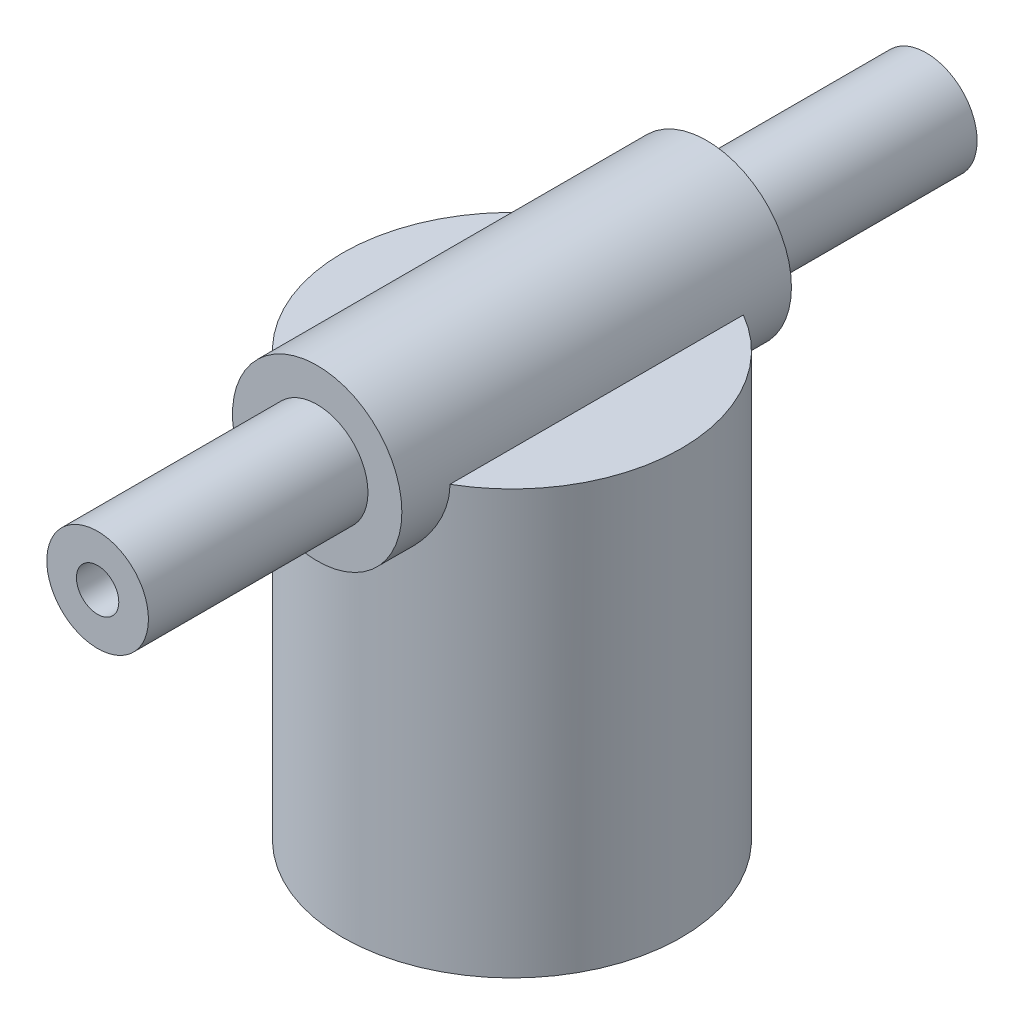
ISO-10303-21;
HEADER;
FILE_DESCRIPTION(('STEP AP214'),'2;1');
FILE_NAME('part.step','',(''),(''),'','','');
FILE_SCHEMA(('AUTOMOTIVE_DESIGN { 1 0 10303 214 1 1 1 1 }'));
ENDSEC;
DATA;
#1=APPLICATION_CONTEXT('core data for automotive mechanical design processes');
#2=APPLICATION_PROTOCOL_DEFINITION('international standard','automotive_design',2000,#1);
#3=PRODUCT_CONTEXT('',#1,'mechanical');
#4=PRODUCT('Part','Part','',(#3));
#5=PRODUCT_RELATED_PRODUCT_CATEGORY('part','',(#4));
#6=PRODUCT_DEFINITION_FORMATION('','',#4);
#7=PRODUCT_DEFINITION_CONTEXT('part definition',#1,'design');
#8=PRODUCT_DEFINITION('design','',#6,#7);
#9=PRODUCT_DEFINITION_SHAPE('','',#8);
#10=(LENGTH_UNIT() NAMED_UNIT(*) SI_UNIT(.MILLI.,.METRE.));
#11=(NAMED_UNIT(*) PLANE_ANGLE_UNIT() SI_UNIT($,.RADIAN.));
#12=(NAMED_UNIT(*) SI_UNIT($,.STERADIAN.) SOLID_ANGLE_UNIT());
#13=UNCERTAINTY_MEASURE_WITH_UNIT(LENGTH_MEASURE(1.E-05),#10,'distance_accuracy_value','');
#14=(GEOMETRIC_REPRESENTATION_CONTEXT(3) GLOBAL_UNCERTAINTY_ASSIGNED_CONTEXT((#13)) GLOBAL_UNIT_ASSIGNED_CONTEXT((#10,
#11,#12)) REPRESENTATION_CONTEXT('',''));
#15=CARTESIAN_POINT('',(0.,0.,0.));
#16=DIRECTION('',(0.,0.,1.));
#17=DIRECTION('',(1.,0.,0.));
#18=AXIS2_PLACEMENT_3D('',#15,#16,#17);
#19=CARTESIAN_POINT('',(0.,50.,0.));
#20=DIRECTION('',(0.,-1.,0.));
#21=DIRECTION('',(0.,0.,-1.));
#22=AXIS2_PLACEMENT_3D('',#19,#20,#21);
#23=CYLINDRICAL_SURFACE('',#22,20.);
#24=CARTESIAN_POINT('',(0.,0.,0.));
#25=DIRECTION('',(0.,1.,0.));
#26=DIRECTION('',(0.,0.,1.));
#27=AXIS2_PLACEMENT_3D('',#24,#25,#26);
#28=CIRCLE('',#27,20.);
#29=CARTESIAN_POINT('',(0.,0.,20.));
#30=VERTEX_POINT('',#29);
#31=EDGE_CURVE('E75',#30,#30,#28,.T.);
#32=ORIENTED_EDGE('',*,*,#31,.T.);
#33=EDGE_LOOP('',(#32));
#34=FACE_BOUND('',#33,.T.);
#35=CARTESIAN_POINT('',(0.,60.,-20.));
#36=CARTESIAN_POINT('',(0.26297774757047,59.9999991311544,-19.9999992010162));
#37=CARTESIAN_POINT('',(0.525973881907791,59.9896144860554,-19.9948010837));
#38=CARTESIAN_POINT('',(1.05002923117121,59.9481941751404,-19.9741395354228));
#39=CARTESIAN_POINT('',(1.31108755349614,59.9171495254669,-19.9586716387275));
#40=CARTESIAN_POINT('',(1.82963226043827,59.8347080895986,-19.9178362229901));
#41=CARTESIAN_POINT('',(2.08711188872546,59.7832771145179,-19.8924520749392));
#42=CARTESIAN_POINT('',(2.59618182802919,59.6606617858704,-19.8324363448083));
#43=CARTESIAN_POINT('',(2.847772725312,59.5894794078488,-19.7978056875818));
#44=CARTESIAN_POINT('',(3.34246836822569,59.4284309978279,-19.720303023444));
#45=CARTESIAN_POINT('',(3.58560245696295,59.3386391325444,-19.6774637808779));
#46=CARTESIAN_POINT('',(4.06298432085465,59.1410556783159,-19.5844658749963));
#47=CARTESIAN_POINT('',(4.29723190454895,59.0332637018277,-19.5343070540929));
#48=CARTESIAN_POINT('',(4.75551398861712,58.8006307634748,-19.4278257394007));
#49=CARTESIAN_POINT('',(4.97955221985718,58.6757960973552,-19.371505523214));
#50=CARTESIAN_POINT('',(5.41653080360957,58.4099130709816,-19.2538936046229));
#51=CARTESIAN_POINT('',(5.62946673237805,58.2688583184689,-19.1925999450287));
#52=CARTESIAN_POINT('',(6.05571153636931,57.9624954366143,-19.0625536763854));
#53=CARTESIAN_POINT('',(6.2682689260733,57.7962377965806,-18.9935741626949));
#54=CARTESIAN_POINT('',(6.67880739057353,57.4475548696851,-18.8531326273725));
#55=CARTESIAN_POINT('',(6.8767876309065,57.265128658575,-18.7816704639663));
#56=CARTESIAN_POINT('',(7.25738906236846,56.8849614203297,-18.6379106306311));
#57=CARTESIAN_POINT('',(7.44000060064986,56.6872109157941,-18.5656124675679));
#58=CARTESIAN_POINT('',(7.7888836174931,56.2773980437752,-18.4219676840917));
#59=CARTESIAN_POINT('',(7.95515202519227,56.0653329991786,-18.3506212446753));
#60=CARTESIAN_POINT('',(8.2827111057377,55.6108068013796,-18.2052535437119));
#61=CARTESIAN_POINT('',(8.44260565220417,55.3672646356158,-18.1314567024133));
#62=CARTESIAN_POINT('',(8.7410914220852,54.8660415201669,-17.9894590508883));
#63=CARTESIAN_POINT('',(8.87969167215242,54.6083666245536,-17.9212558752544));
#64=CARTESIAN_POINT('',(9.13438777848808,54.0803007968687,-17.7927881626278));
#65=CARTESIAN_POINT('',(9.25049044721743,53.8099137450612,-17.7325212242509));
#66=CARTESIAN_POINT('',(9.45894522420918,53.25811404655,-17.6222099564149));
#67=CARTESIAN_POINT('',(9.55129996419766,52.9767026255442,-17.5721644943465));
#68=CARTESIAN_POINT('',(9.70625458779874,52.4220849599405,-17.4870229092242));
#69=CARTESIAN_POINT('',(9.77030307761469,52.14939374522,-17.4512120054423));
#70=CARTESIAN_POINT('',(9.87543221046261,51.5982835344642,-17.3919377517219));
#71=CARTESIAN_POINT('',(9.91651383598184,51.3198647839724,-17.368473873599));
#72=CARTESIAN_POINT('',(9.97504777353869,50.7599854008135,-17.3349233192211));
#73=CARTESIAN_POINT('',(9.99252007209236,50.478527544653,-17.3248253281998));
#74=CARTESIAN_POINT('',(10.0036080043825,49.914997490163,-17.3184259915651));
#75=CARTESIAN_POINT('',(9.99722591425208,49.6329253530135,-17.3221233296318));
#76=CARTESIAN_POINT('',(9.96291632672931,49.1045952020966,-17.3418743842694));
#77=CARTESIAN_POINT('',(9.93766509151721,48.8580998286423,-17.3563927185974));
#78=CARTESIAN_POINT('',(9.8690882825972,48.3683607757045,-17.3954780340008));
#79=CARTESIAN_POINT('',(9.82575672853391,48.1251181996355,-17.4200483398744));
#80=CARTESIAN_POINT('',(9.72152759312325,47.6436082749706,-17.4784283554102));
#81=CARTESIAN_POINT('',(9.66063238238804,47.4053402595966,-17.5122368181421));
#82=CARTESIAN_POINT('',(9.52187989459161,46.9350464357646,-17.5880654989193));
#83=CARTESIAN_POINT('',(9.44401584795466,46.7030231602177,-17.6300889935922));
#84=CARTESIAN_POINT('',(9.27007793534025,46.2412894084719,-17.7221768246774));
#85=CARTESIAN_POINT('',(9.17362860412847,46.0117529467327,-17.7724029635355));
#86=CARTESIAN_POINT('',(8.96447979140212,45.5615618305034,-17.878810533816));
#87=CARTESIAN_POINT('',(8.85177491107831,45.3409101581057,-17.9349939421242));
#88=CARTESIAN_POINT('',(8.61087933619458,44.909438225384,-18.0518884826287));
#89=CARTESIAN_POINT('',(8.4826858636817,44.6986197381147,-18.1126004262899));
#90=CARTESIAN_POINT('',(8.21155546672611,44.2876476337912,-18.2371218065418));
#91=CARTESIAN_POINT('',(8.06861764351119,44.0874946680049,-18.3009314318325));
#92=CARTESIAN_POINT('',(7.74962298190964,43.6738683200168,-18.4384710076206));
#93=CARTESIAN_POINT('',(7.57166567582239,43.461933896661,-18.5124312542501));
#94=CARTESIAN_POINT('',(7.19890817206694,43.0536251358376,-18.6605447929763));
#95=CARTESIAN_POINT('',(7.00411219662653,42.8572469212453,-18.7346980321841));
#96=CARTESIAN_POINT('',(6.5984132459434,42.4808534192401,-18.8814062531242));
#97=CARTESIAN_POINT('',(6.38749704374536,42.3008518402428,-18.9539598580541));
#98=CARTESIAN_POINT('',(5.9507961704325,41.9585471364973,-19.0955673475654));
#99=CARTESIAN_POINT('',(5.72501741077281,41.7962370425202,-19.164622604476));
#100=CARTESIAN_POINT('',(5.24872768197162,41.4832041345111,-19.3006480329725));
#101=CARTESIAN_POINT('',(4.99755374827171,41.3333791540281,-19.3673693587667));
#102=CARTESIAN_POINT('',(4.48152997851448,41.0556307630696,-19.4932401539485));
#103=CARTESIAN_POINT('',(4.21667950634011,40.927708372514,-19.5523892706948));
#104=CARTESIAN_POINT('',(3.67526022803787,40.6952056965372,-19.6613492326779));
#105=CARTESIAN_POINT('',(3.39869900661396,40.5906105697672,-19.7111660121174));
#106=CARTESIAN_POINT('',(2.83582264507486,40.4059492211278,-19.7999810198758));
#107=CARTESIAN_POINT('',(2.54950863124167,40.3258801775116,-19.8389804926862));
#108=CARTESIAN_POINT('',(1.99360082076711,40.1969341388409,-19.9021913169255));
#109=CARTESIAN_POINT('',(1.72458658463508,40.1460227570388,-19.9273600412885));
#110=CARTESIAN_POINT('',(1.18250594424724,40.0663848419067,-19.9668602547768));
#111=CARTESIAN_POINT('',(0.909439761223924,40.03765710188,-19.9811923333691));
#112=CARTESIAN_POINT('',(0.361621452061382,40.0027736792174,-19.9986076087938));
#113=CARTESIAN_POINT('',(0.0868700440476493,39.9966089716722,-20.0016953032259));
#114=CARTESIAN_POINT('',(-0.462095284936296,40.0069111876297,-19.996544733302));
#115=CARTESIAN_POINT('',(-0.736309229155635,40.0233771095491,-19.9883069701865));
#116=CARTESIAN_POINT('',(-1.26069578442055,40.0765620616977,-19.9618171280824));
#117=CARTESIAN_POINT('',(-1.51108216427542,40.1116095728205,-19.9443921243345));
#118=CARTESIAN_POINT('',(-2.00770334634759,40.2003699951794,-19.9005341339856));
#119=CARTESIAN_POINT('',(-2.25393841461836,40.2540817054405,-19.8741017269811));
#120=CARTESIAN_POINT('',(-2.7406844611906,40.3796139920955,-19.812845023159));
#121=CARTESIAN_POINT('',(-2.98119512032807,40.4514355756276,-19.7780202596251));
#122=CARTESIAN_POINT('',(-3.45505082107349,40.6124946583728,-19.7007681992834));
#123=CARTESIAN_POINT('',(-3.68839556112771,40.7017328893482,-19.6583405830473));
#124=CARTESIAN_POINT('',(-4.15316088617015,40.8996247243195,-19.5655046555384));
#125=CARTESIAN_POINT('',(-4.38433936906094,41.008757038834,-19.5149041886911));
#126=CARTESIAN_POINT('',(-4.83663774643759,41.2437478963626,-19.4077573479828));
#127=CARTESIAN_POINT('',(-5.05775400766403,41.3696124177045,-19.3512088504371));
#128=CARTESIAN_POINT('',(-5.70436813169987,41.7709434864471,-19.1744474473865));
#129=CARTESIAN_POINT('',(-6.11337858448959,42.070253667661,-19.0470672570173));
#130=CARTESIAN_POINT('',(-6.91779518371264,42.7577005416899,-18.7707873202954));
#131=CARTESIAN_POINT('',(-7.30792110762594,43.1516737079917,-18.6210027147805));
#132=CARTESIAN_POINT('',(-7.84082560671492,43.7872605585902,-18.3999640224111));
#133=CARTESIAN_POINT('',(-8.00984942409511,44.0067352134642,-18.3268393772916));
#134=CARTESIAN_POINT('',(-8.32960568094727,44.4597394427642,-18.183737266458));
#135=CARTESIAN_POINT('',(-8.4803354830786,44.6932710364541,-18.1137602554328));
#136=CARTESIAN_POINT('',(-8.76928163027866,45.1849259938434,-17.9757225676596));
#137=CARTESIAN_POINT('',(-8.90652817819507,45.4436933067517,-17.9079221139821));
#138=CARTESIAN_POINT('',(-9.15837639012035,45.9738115445517,-17.7804404562871));
#139=CARTESIAN_POINT('',(-9.27298894306127,46.2451563406136,-17.7207553524022));
#140=CARTESIAN_POINT('',(-9.47827705930681,46.7985498632991,-17.6118078617936));
#141=CARTESIAN_POINT('',(-9.56897185129601,47.0805897816227,-17.5625371088176));
#142=CARTESIAN_POINT('',(-9.72530086409336,47.6533832153516,-17.4764560330943));
#143=CARTESIAN_POINT('',(-9.79093896514153,47.9441353740658,-17.4396437811433));
#144=CARTESIAN_POINT('',(-9.89107565144743,48.5035247967187,-17.3830260812378));
#145=CARTESIAN_POINT('',(-9.92795857968716,48.7716057546725,-17.3619273114046));
#146=CARTESIAN_POINT('',(-9.97987692141645,49.3105606593006,-17.332136815937));
#147=CARTESIAN_POINT('',(-9.99491382071395,49.5814344147671,-17.3234442465237));
#148=CARTESIAN_POINT('',(-10.0029096686844,50.1235135688981,-17.3188284226879));
#149=CARTESIAN_POINT('',(-9.9958767833924,50.39471880779,-17.3229004452416));
#150=CARTESIAN_POINT('',(-9.95985898725887,50.9351721097639,-17.3436339919872));
#151=CARTESIAN_POINT('',(-9.93087497508662,51.2044202525128,-17.3602950007916));
#152=CARTESIAN_POINT('',(-9.85519722920277,51.7131144453934,-17.4033551463061));
#153=CARTESIAN_POINT('',(-9.81046230963215,51.9529480089251,-17.4286705637748));
#154=CARTESIAN_POINT('',(-9.70388285528388,52.4277291978268,-17.4882355534742));
#155=CARTESIAN_POINT('',(-9.6420326592858,52.6626751788365,-17.5224880816187));
#156=CARTESIAN_POINT('',(-9.50186064219782,53.126223616403,-17.5988921487312));
#157=CARTESIAN_POINT('',(-9.42354151869525,53.3548271049183,-17.6410423939411));
#158=CARTESIAN_POINT('',(-9.25107208633864,53.8046984883442,-17.7320944008379));
#159=CARTESIAN_POINT('',(-9.15691467555994,54.0259630389356,-17.7809991895098));
#160=CARTESIAN_POINT('',(-8.94668289722952,54.4746258921229,-17.8877520145129));
#161=CARTESIAN_POINT('',(-8.82956366921284,54.7014441786001,-17.9459794825375));
#162=CARTESIAN_POINT('',(-8.57895403368727,55.144545430872,-18.067122458149));
#163=CARTESIAN_POINT('',(-8.44546216273868,55.3608274524837,-18.130038384608));
#164=CARTESIAN_POINT('',(-8.16285657798003,55.7820513773595,-18.2590224525038));
#165=CARTESIAN_POINT('',(-8.01373739051541,55.9869892685381,-18.3250916939848));
#166=CARTESIAN_POINT('',(-7.70065351710477,56.3846685995703,-18.4588439084551));
#167=CARTESIAN_POINT('',(-7.53668670721057,56.5774082877534,-18.5265271112979));
#168=CARTESIAN_POINT('',(-7.17380336462424,56.9725890708702,-18.6702735648096));
#169=CARTESIAN_POINT('',(-6.97306234663123,57.1733531745623,-18.746353564782));
#170=CARTESIAN_POINT('',(-6.55492133587247,57.557351407736,-18.8966226391637));
#171=CARTESIAN_POINT('',(-6.33752607360945,57.7405904820546,-18.9708122426046));
#172=CARTESIAN_POINT('',(-5.88693376044406,58.0885782201041,-19.1154396310611));
#173=CARTESIAN_POINT('',(-5.65372458790795,58.2533124366426,-19.1858744624017));
#174=CARTESIAN_POINT('',(-5.1728954421103,58.5628791276405,-19.3210638569054));
#175=CARTESIAN_POINT('',(-4.92527630037179,58.70771274884,-19.3858187472881));
#176=CARTESIAN_POINT('',(-4.41518835199793,58.9771882779968,-19.5083417849818));
#177=CARTESIAN_POINT('',(-4.15262447046932,59.101675330338,-19.5660555714726));
#178=CARTESIAN_POINT('',(-3.61607511779452,59.3278473632244,-19.6722841833782));
#179=CARTESIAN_POINT('',(-3.34209105214395,59.4295351399349,-19.7208001367275));
#180=CARTESIAN_POINT('',(-2.78539452130531,59.6086874933069,-19.8070877528213));
#181=CARTESIAN_POINT('',(-2.50270444198693,59.6862092878952,-19.8448847753657));
#182=CARTESIAN_POINT('',(-1.93047321727417,59.8162760900685,-19.908692874149));
#183=CARTESIAN_POINT('',(-1.64093637072212,59.8688363547921,-19.9347111494098));
#184=CARTESIAN_POINT('',(-1.12608352412093,59.9389489035084,-19.9695276660452));
#185=CARTESIAN_POINT('',(-0.90165168027671,59.961823466314,-19.9809348086311));
#186=CARTESIAN_POINT('',(-0.451484431282411,59.9923495975715,-19.9961714231232));
#187=CARTESIAN_POINT('',(-0.225748990324603,60.0000007458465,-20.0000006858747));
#188=CARTESIAN_POINT('',(0.,60.,-20.));
#189=B_SPLINE_CURVE_WITH_KNOTS('',3,(#35,#36,#37,#38,#39,#40,#41,#42,#43,#44,#45,#46,#47,#48,
#49,#50,#51,#52,#53,#54,#55,#56,#57,#58,#59,#60,#61,#62,#63,#64,#65,#66,#67,#68,#69,#70,#71,#72,
#73,#74,#75,#76,#77,#78,#79,#80,#81,#82,#83,#84,#85,#86,#87,#88,#89,#90,#91,#92,#93,#94,#95,#96,
#97,#98,#99,#100,#101,#102,#103,#104,#105,#106,#107,#108,#109,#110,#111,#112,#113,#114,#115,
#116,#117,#118,#119,#120,#121,#122,#123,#124,#125,#126,#127,#128,#129,#130,#131,#132,#133,#134,
#135,#136,#137,#138,#139,#140,#141,#142,#143,#144,#145,#146,#147,#148,#149,#150,#151,#152,#153,
#154,#155,#156,#157,#158,#159,#160,#161,#162,#163,#164,#165,#166,#167,#168,#169,#170,#171,#172,
#173,#174,#175,#176,#177,#178,#179,#180,#181,#182,#183,#184,#185,#186,#187,#188),.UNSPECIFIED.,
.T.,.F.,(4,2,2,2,2,2,2,2,2,2,2,2,2,2,2,2,2,2,2,2,2,2,2,2,2,2,2,2,2,2,2,2,2,2,2,2,2,2,2,2,2,2,2,
2,2,2,2,2,2,2,2,2,2,2,2,2,2,2,2,2,2,2,2,2,2,2,2,2,2,2,2,2,2,2,2,2,4),(0.,0.788710589251,
1.57776436803952,2.36814706638947,3.15845073874465,3.94566328103175,4.73289277422683,
5.51983223968627,6.30708290401819,7.14179607204602,7.97655698581611,8.81183834708134,
9.64727635829488,10.5477781072243,11.447897073936,12.3477430494904,13.2474892618302,
14.0934532489038,14.9393810441651,15.7845922682139,16.6297228461313,17.3734776288846,
18.1174786157194,18.8613792297722,19.6055771618311,20.3667813084855,21.1282388516736,
21.889833169209,22.6514739387577,23.509891476961,24.3680943913845,25.2270091977564,
26.0855844184835,26.9843425878092,27.8831425974923,28.7813691279581,29.679492277851,
30.5032194900487,31.3269018918016,32.1502547956571,32.9735712608452,33.7329722323226,
34.4923243480979,35.2517187027837,36.0111449703724,36.7921013676949,37.5733375502822,
39.1349970223263,40.8500130119071,41.7087612506847,42.5676331434658,43.4684238669888,
44.3687801699595,45.2684104094407,46.1679012770191,46.9810473193187,47.7941380547513,
48.606927974181,49.4196846201562,50.1547113408423,50.889981477547,51.6251312717133,
52.3606115917998,53.1452977478639,53.9300540928963,54.7150862327853,55.5002308492403,
56.3809909668478,57.2615018327172,58.1426954259119,59.0238382204153,59.9114030040692,
60.7988588747469,61.6841972652664,62.5689938151569,63.2460309664337,63.9230868041488),.UNSPECIFIED.);
#190=CARTESIAN_POINT('',(10.,50.,-17.3205080756888));
#191=VERTEX_POINT('',#190);
#192=CARTESIAN_POINT('',(-10.,50.,-17.3205080756888));
#193=VERTEX_POINT('',#192);
#194=EDGE_CURVE('E52',#191,#193,#189,.T.);
#195=ORIENTED_EDGE('',*,*,#194,.F.);
#196=CARTESIAN_POINT('',(0.,50.,0.));
#197=DIRECTION('',(0.,1.,0.));
#198=DIRECTION('',(0.,0.,1.));
#199=AXIS2_PLACEMENT_3D('',#196,#197,#198);
#200=CIRCLE('',#199,20.);
#201=CARTESIAN_POINT('',(10.,50.,17.3205080756888));
#202=VERTEX_POINT('',#201);
#203=EDGE_CURVE('E71',#202,#191,#200,.T.);
#204=ORIENTED_EDGE('',*,*,#203,.F.);
#205=CARTESIAN_POINT('',(-10.,50.,17.3205080756888));
#206=CARTESIAN_POINT('',(-9.99999887830497,49.7393369593989,17.3205095702683));
#207=CARTESIAN_POINT('',(-9.98979463038363,49.4786512234219,17.3264124109147));
#208=CARTESIAN_POINT('',(-9.94911125215874,48.9592885228944,17.3498046872689));
#209=CARTESIAN_POINT('',(-9.91862268285217,48.7006125502768,17.3672995171185));
#210=CARTESIAN_POINT('',(-9.83771551508561,48.1869766185068,17.4132568469047));
#211=CARTESIAN_POINT('',(-9.78726564599456,47.9320231438101,17.4417365535713));
#212=CARTESIAN_POINT('',(-9.66704369384918,47.4279501180264,17.5086546907093));
#213=CARTESIAN_POINT('',(-9.59726323891774,47.178833145483,17.5470974356035));
#214=CARTESIAN_POINT('',(-9.43962165537102,46.689526319113,17.6323996319525));
#215=CARTESIAN_POINT('',(-9.3518675445998,46.4492931314373,17.6792090659448));
#216=CARTESIAN_POINT('',(-9.15882440342409,45.9774457731586,17.779982741108));
#217=CARTESIAN_POINT('',(-9.05352901444523,45.7458347654115,17.8339495753282));
#218=CARTESIAN_POINT('',(-8.82628481748803,45.2924546089845,17.9475017275461));
#219=CARTESIAN_POINT('',(-8.70433993726486,45.0706831553715,18.007085719386));
#220=CARTESIAN_POINT('',(-8.44458163828187,44.6378403326671,18.1303531605008));
#221=CARTESIAN_POINT('',(-8.30676769705149,44.4267693162049,18.1940367447196));
#222=CARTESIAN_POINT('',(-8.00400718237261,43.9991624699219,18.329363902558));
#223=CARTESIAN_POINT('',(-7.83775940314261,43.783617507037,18.4012302839619));
#224=CARTESIAN_POINT('',(-7.48852658775189,43.3670650897856,18.5460965168945));
#225=CARTESIAN_POINT('',(-7.30554585569179,43.1660539206811,18.6190960729559));
#226=CARTESIAN_POINT('',(-6.92354675196283,42.7793054363261,18.7644955635795));
#227=CARTESIAN_POINT('',(-6.72451542443151,42.5935807094508,18.836894960655));
#228=CARTESIAN_POINT('',(-6.31154503656169,42.2386532168736,18.9792540720478));
#229=CARTESIAN_POINT('',(-6.09761130143478,42.0694446006956,19.0492146445795));
#230=CARTESIAN_POINT('',(-5.64077435798557,41.7376358680964,19.1896470662367));
#231=CARTESIAN_POINT('',(-5.39689043752675,41.5762607473725,19.2598322512756));
#232=CARTESIAN_POINT('',(-4.89454568059951,41.2747934358672,19.3935808273359));
#233=CARTESIAN_POINT('',(-4.63608400824709,41.1347024672174,19.4571438380477));
#234=CARTESIAN_POINT('',(-4.10635184715094,40.8772510748047,19.5757886087363));
#235=CARTESIAN_POINT('',(-3.83508764838736,40.759879630429,19.6308744780683));
#236=CARTESIAN_POINT('',(-3.28159286613366,40.5491370230558,19.7309453282108));
#237=CARTESIAN_POINT('',(-2.99936345112905,40.4557633108209,19.775931381843));
#238=CARTESIAN_POINT('',(-2.44661617022939,40.2999712240936,19.8516061014691));
#239=CARTESIAN_POINT('',(-2.17669338788491,40.2358232987512,19.8830841882928));
#240=CARTESIAN_POINT('',(-1.6314331616739,40.1300693320821,19.9352303438994));
#241=CARTESIAN_POINT('',(-1.35609595376428,40.0884623106847,19.9558988826763));
#242=CARTESIAN_POINT('',(-0.802434144223487,40.0283601805839,19.9858180043386));
#243=CARTESIAN_POINT('',(-0.524111138001231,40.0098532940536,19.9950744057828));
#244=CARTESIAN_POINT('',(0.0332441550447307,39.996171373195,20.001913600906));
#245=CARTESIAN_POINT('',(0.312276397429635,40.0009949113911,19.9994971087928));
#246=CARTESIAN_POINT('',(0.844365378154718,40.0324639568942,19.9837839047877));
#247=CARTESIAN_POINT('',(1.09756809880906,40.0571725468262,19.9714530082902));
#248=CARTESIAN_POINT('',(1.60072224441901,40.1256826228858,19.9374335863625));
#249=CARTESIAN_POINT('',(1.85067389700142,40.1694827648075,19.9157457197429));
#250=CARTESIAN_POINT('',(2.34564683757824,40.275699611417,19.8635314520899));
#251=CARTESIAN_POINT('',(2.59066796468298,40.3381169225597,19.8330047631323));
#252=CARTESIAN_POINT('',(3.0742307116896,40.4809309898285,19.7638249456672));
#253=CARTESIAN_POINT('',(3.3127720985195,40.5613283917286,19.7251715252824));
#254=CARTESIAN_POINT('',(3.78519130198348,40.7405720561662,19.6400278970987));
#255=CARTESIAN_POINT('',(4.01896179863547,40.8396540243545,19.5934383954188));
#256=CARTESIAN_POINT('',(4.47722728595916,41.0546901996087,19.4938328204623));
#257=CARTESIAN_POINT('',(4.70171895241328,41.1706503873064,19.4408144703024));
#258=CARTESIAN_POINT('',(5.35951935176704,41.5425147140062,19.2738101334568));
#259=CARTESIAN_POINT('',(5.77743819792881,41.82251161096,19.1518214470897));
#260=CARTESIAN_POINT('',(6.60185513584859,42.4690400071389,18.8844067887046));
#261=CARTESIAN_POINT('',(7.00353936956525,42.8412495046489,18.7378553723017));
#262=CARTESIAN_POINT('',(7.5565805421889,43.4446384171899,18.5185765182046));
#263=CARTESIAN_POINT('',(7.73279224461712,43.6534519652021,18.4455210194507));
#264=CARTESIAN_POINT('',(8.06791510126962,44.0853226737244,18.301419633557));
#265=CARTESIAN_POINT('',(8.22682364112474,44.3083819785988,18.2303740512964));
#266=CARTESIAN_POINT('',(8.53586780278159,44.7823337169177,18.0878347411401));
#267=CARTESIAN_POINT('',(8.68479491188952,45.0340939107024,18.0166021936665));
#268=CARTESIAN_POINT('',(8.96061518558477,45.5510506721991,17.8810231107822));
#269=CARTESIAN_POINT('',(9.08751826340233,45.8162411250216,17.8166734823335));
#270=CARTESIAN_POINT('',(9.31801905264336,46.35840289916,17.6972138879565));
#271=CARTESIAN_POINT('',(9.42163054141924,46.6353671401769,17.6420984647868));
#272=CARTESIAN_POINT('',(9.60435110537391,47.1992437897328,17.5432965504952));
#273=CARTESIAN_POINT('',(9.68346352159404,47.4861548358449,17.4996085011007));
#274=CARTESIAN_POINT('',(9.81078056042748,48.0445047326677,17.4285246280669));
#275=CARTESIAN_POINT('',(9.86093677879992,48.3153693858063,17.400112529026));
#276=CARTESIAN_POINT('',(9.93878416908062,48.8613257442895,17.3557653968311));
#277=CARTESIAN_POINT('',(9.96647661050595,49.1364172098648,17.3398296585902));
#278=CARTESIAN_POINT('',(9.99895720583311,49.6882306941949,17.3211203070709));
#279=CARTESIAN_POINT('',(10.0037591970207,49.964951626605,17.3183387420978));
#280=CARTESIAN_POINT('',(9.99041751959192,50.5176428476257,17.3260388316313));
#281=CARTESIAN_POINT('',(9.97227539979392,50.7936131856442,17.3365195908785));
#282=CARTESIAN_POINT('',(9.91658048540566,51.3121699019884,17.3684286609902));
#283=CARTESIAN_POINT('',(9.88137691490021,51.5550956486594,17.3885290217086));
#284=CARTESIAN_POINT('',(9.79342893834459,52.0368418013589,17.4382137869217));
#285=CARTESIAN_POINT('',(9.74067872487189,52.2756608206227,17.467801331278));
#286=CARTESIAN_POINT('',(9.61821012578335,52.7476271933496,17.5355331166034));
#287=CARTESIAN_POINT('',(9.54849400477787,52.9807752992018,17.5736762155234));
#288=CARTESIAN_POINT('',(9.39275103363472,53.4402243463203,17.6574071681516));
#289=CARTESIAN_POINT('',(9.30671771455722,53.6665225305397,17.7029979734995));
#290=CARTESIAN_POINT('',(9.01657018480756,54.3538380876178,17.8535843814249));
#291=CARTESIAN_POINT('',(8.78600743614721,54.80167280554,17.9691397733146));
#292=CARTESIAN_POINT('',(8.26280380655757,55.6548101387903,18.2156365133527));
#293=CARTESIAN_POINT('',(7.97013103597559,56.06009074482,18.3465857498225));
#294=CARTESIAN_POINT('',(7.46888401537909,56.6554100003159,18.5540860890308));
#295=CARTESIAN_POINT('',(7.27935116097346,56.862193409628,18.6294365394137));
#296=CARTESIAN_POINT('',(6.88345408602484,57.2592423375631,18.7793184193833));
#297=CARTESIAN_POINT('',(6.67709486873342,57.4495127317777,18.8538500850067));
#298=CARTESIAN_POINT('',(6.24838707618252,57.8125944802204,19.0002370989649));
#299=CARTESIAN_POINT('',(6.0260266588536,57.9853926714716,19.0720904041602));
#300=CARTESIAN_POINT('',(5.56664786728032,58.312150006922,19.2111944255316));
#301=CARTESIAN_POINT('',(5.32963579644158,58.466117168817,19.2784470951099));
#302=CARTESIAN_POINT('',(4.83560208582896,58.7579356545004,19.4083463032874));
#303=CARTESIAN_POINT('',(4.57821478300823,58.8952456931089,19.4708214998861));
#304=CARTESIAN_POINT('',(4.05082787591117,59.1474709202509,19.5873354303861));
#305=CARTESIAN_POINT('',(3.78082784931274,59.2623853582269,19.6413738815295));
#306=CARTESIAN_POINT('',(3.23033940661204,59.4684323965666,19.7393769209225));
#307=CARTESIAN_POINT('',(2.94985864767703,59.5595819854966,19.7833487026856));
#308=CARTESIAN_POINT('',(2.38049331567771,59.7170190622386,19.8599022734451));
#309=CARTESIAN_POINT('',(2.09160974353147,59.7833094982363,19.8924854130529));
#310=CARTESIAN_POINT('',(1.53480500342459,59.8851895319255,19.9427983622959));
#311=CARTESIAN_POINT('',(1.26739371229205,59.9230386676768,19.9616170482062));
#312=CARTESIAN_POINT('',(0.729851996988028,59.9769866986071,19.9884894545243));
#313=CARTESIAN_POINT('',(0.459721746484664,59.9930869741807,19.9965438581379));
#314=CARTESIAN_POINT('',(-0.0809759419303002,60.003326494719,20.0016629969108));
#315=CARTESIAN_POINT('',(-0.351543225574784,59.9974722825172,19.998731006214));
#316=CARTESIAN_POINT('',(-0.89097156797991,59.9638943287181,19.9819662987136));
#317=CARTESIAN_POINT('',(-1.15983267350619,59.9361711891718,19.9681338819984));
#318=CARTESIAN_POINT('',(-1.67605139696945,59.8617599215399,19.9312153598393));
#319=CARTESIAN_POINT('',(-1.9236568390133,59.81644464428,19.9088004475429));
#320=CARTESIAN_POINT('',(-2.41384547185346,59.707542492153,19.8553300434365));
#321=CARTESIAN_POINT('',(-2.65642894535069,59.6439566488029,19.8242750394308));
#322=CARTESIAN_POINT('',(-3.13506320784848,59.4991522587388,19.7542370428942));
#323=CARTESIAN_POINT('',(-3.3711145923855,59.4179353254784,19.7152547758225));
#324=CARTESIAN_POINT('',(-3.83546861689578,59.2385691290438,19.6302044089834));
#325=CARTESIAN_POINT('',(-4.06376823706492,59.1404133556664,19.5841335855708));
#326=CARTESIAN_POINT('',(-4.52085803757348,58.9234816285729,19.483810895842));
#327=CARTESIAN_POINT('',(-4.74925902682011,58.8040081247,19.4292950766497));
#328=CARTESIAN_POINT('',(-5.19522438508584,58.5484340574125,19.3148302804231));
#329=CARTESIAN_POINT('',(-5.41278502408941,58.412327825767,19.2548794530109));
#330=CARTESIAN_POINT('',(-5.83606045705828,58.1244032703331,19.1308402275846));
#331=CARTESIAN_POINT('',(-6.04177287147123,57.9725818073649,19.0667510038749));
#332=CARTESIAN_POINT('',(-6.44045588132559,57.6541249910566,18.9358010862794));
#333=CARTESIAN_POINT('',(-6.63342576869236,57.4874888157003,18.8689402387161));
#334=CARTESIAN_POINT('',(-7.02443076725262,57.1229047259284,18.7271146644604));
#335=CARTESIAN_POINT('',(-7.22105023736916,56.9234915542395,18.6520069761602));
#336=CARTESIAN_POINT('',(-7.59688252262079,56.5088897954372,18.5021161963615));
#337=CARTESIAN_POINT('',(-7.77610015155212,56.2937056000631,18.4273330205942));
#338=CARTESIAN_POINT('',(-8.1163793026012,55.8483328147492,18.2800108882226));
#339=CARTESIAN_POINT('',(-8.27742256848714,55.6181294978645,18.2074742403954));
#340=CARTESIAN_POINT('',(-8.58012843326388,55.1439787632711,18.0668000353187));
#341=CARTESIAN_POINT('',(-8.72178830427269,54.9000294178497,17.9986630979644));
#342=CARTESIAN_POINT('',(-8.98880823408349,54.3916255079798,17.8668466988412));
#343=CARTESIAN_POINT('',(-9.11350193984134,54.1267646386787,17.8033795439981));
#344=CARTESIAN_POINT('',(-9.33972032642159,53.585471614979,17.6857538350981));
#345=CARTESIAN_POINT('',(-9.44125694748286,53.3090455112525,17.6315904873914));
#346=CARTESIAN_POINT('',(-9.61975104079584,52.7471888859999,17.5348420080576));
#347=CARTESIAN_POINT('',(-9.69677174083926,52.4617836482442,17.4922271352712));
#348=CARTESIAN_POINT('',(-9.82541504864774,51.8838144775088,17.420295302782));
#349=CARTESIAN_POINT('',(-9.87705541385782,51.5912557004018,17.3909690467734));
#350=CARTESIAN_POINT('',(-9.94364603197746,51.0820044476176,17.3529508814928));
#351=CARTESIAN_POINT('',(-9.96475859003795,50.866351679704,17.340814385915));
#352=CARTESIAN_POINT('',(-9.99293651062053,50.4338045678709,17.3245920918704));
#353=CARTESIAN_POINT('',(-10.0000009334159,50.216910141866,17.3205068319779));
#354=CARTESIAN_POINT('',(-10.,50.,17.3205080756888));
#355=B_SPLINE_CURVE_WITH_KNOTS('',3,(#205,#206,#207,#208,#209,#210,#211,#212,#213,#214,#215,
#216,#217,#218,#219,#220,#221,#222,#223,#224,#225,#226,#227,#228,#229,#230,#231,#232,#233,#234,
#235,#236,#237,#238,#239,#240,#241,#242,#243,#244,#245,#246,#247,#248,#249,#250,#251,#252,#253,
#254,#255,#256,#257,#258,#259,#260,#261,#262,#263,#264,#265,#266,#267,#268,#269,#270,#271,#272,
#273,#274,#275,#276,#277,#278,#279,#280,#281,#282,#283,#284,#285,#286,#287,#288,#289,#290,#291,
#292,#293,#294,#295,#296,#297,#298,#299,#300,#301,#302,#303,#304,#305,#306,#307,#308,#309,#310,
#311,#312,#313,#314,#315,#316,#317,#318,#319,#320,#321,#322,#323,#324,#325,#326,#327,#328,#329,
#330,#331,#332,#333,#334,#335,#336,#337,#338,#339,#340,#341,#342,#343,#344,#345,#346,#347,#348,
#349,#350,#351,#352,#353,#354),.UNSPECIFIED.,.T.,.F.,(4,2,2,2,2,2,2,2,2,2,2,2,2,2,2,2,2,2,2,2,2,
2,2,2,2,2,2,2,2,2,2,2,2,2,2,2,2,2,2,2,2,2,2,2,2,2,2,2,2,2,2,2,2,2,2,2,2,2,2,2,2,2,2,2,2,2,2,2,2,
2,2,2,2,2,4),(0.,0.781764769112963,1.56389357534752,2.34725251774208,3.13095125664016,
3.91011273597292,4.68955727220399,5.46881824759953,6.24810488660504,7.09181817840652,
7.93531505492037,8.77949974187697,9.62338430104276,10.5244589431129,11.4255853051681,
12.3262734543219,13.2268658853578,14.0633930705159,14.8998838808356,15.735948023788,
16.571961012676,17.3351709001918,18.0983270599865,18.8615080823398,19.6247165195584,
20.3982891735806,21.1721366058307,22.7189130677432,24.411902278383,25.2596540794492,
26.1075337917995,27.0095657903684,27.9111907165882,28.8122809054192,29.7132481546281,
30.542861630924,31.3724282192078,32.2014932705295,33.0305023596626,33.7685142503992,
34.5067706447974,35.244928550686,35.9833797127091,37.5272041097116,39.0718230911075,
39.9423348698488,40.8125887427685,41.6834934262,42.5540260036818,43.4478458060077,
44.3416955583132,45.2349045692787,46.1280076160787,46.9391312005144,47.7502033007272,
48.5610337060351,49.371841789984,50.1291222204446,50.8863599048713,51.6435283222654,
52.4009883973669,53.190547229172,53.980375887315,54.7703626224474,55.5603932185549,
56.4292490887194,57.2978639221841,58.1673436596754,59.0369456360201,59.934364567853,
60.8313197217513,61.7259424792672,62.6199384164504,63.27043863481,63.9209823658393),.UNSPECIFIED.);
#356=CARTESIAN_POINT('',(-10.,50.,17.3205080756888));
#357=VERTEX_POINT('',#356);
#358=EDGE_CURVE('E63',#357,#202,#355,.T.);
#359=ORIENTED_EDGE('',*,*,#358,.F.);
#360=EDGE_CURVE('E69',#193,#357,#200,.T.);
#361=ORIENTED_EDGE('',*,*,#360,.F.);
#362=EDGE_LOOP('',(#195,#204,#359,#361));
#363=FACE_BOUND('',#362,.T.);
#364=ADVANCED_FACE('F37',(#34,#363),#23,.T.);
#365=CARTESIAN_POINT('',(0.,50.,0.));
#366=DIRECTION('',(0.,1.,0.));
#367=DIRECTION('',(0.,0.,1.));
#368=AXIS2_PLACEMENT_3D('',#365,#366,#367);
#369=PLANE('',#368);
#370=ORIENTED_EDGE('',*,*,#203,.T.);
#371=DIRECTION('',(0.,0.,-1.));
#372=VECTOR('',#371,1.);
#373=CARTESIAN_POINT('',(10.,50.,23.));
#374=LINE('',#373,#372);
#375=EDGE_CURVE('E56',#191,#202,#374,.F.);
#376=ORIENTED_EDGE('',*,*,#375,.T.);
#377=EDGE_LOOP('',(#370,#376));
#378=FACE_BOUND('',#377,.T.);
#379=ADVANCED_FACE('F136',(#378),#369,.T.);
#380=ORIENTED_EDGE('',*,*,#360,.T.);
#381=DIRECTION('',(0.,0.,-1.));
#382=VECTOR('',#381,1.);
#383=CARTESIAN_POINT('',(-10.,50.,23.));
#384=LINE('',#383,#382);
#385=EDGE_CURVE('E11',#357,#193,#384,.T.);
#386=ORIENTED_EDGE('',*,*,#385,.T.);
#387=EDGE_LOOP('',(#380,#386));
#388=FACE_BOUND('',#387,.T.);
#389=ADVANCED_FACE('F74',(#388),#369,.T.);
#390=CARTESIAN_POINT('',(0.,0.,0.));
#391=DIRECTION('',(0.,1.,0.));
#392=DIRECTION('',(0.,0.,1.));
#393=AXIS2_PLACEMENT_3D('',#390,#391,#392);
#394=PLANE('',#393);
#395=ORIENTED_EDGE('',*,*,#31,.F.);
#396=EDGE_LOOP('',(#395));
#397=FACE_BOUND('',#396,.T.);
#398=ADVANCED_FACE('F139',(#397),#394,.F.);
#399=CARTESIAN_POINT('',(0.,50.,23.));
#400=DIRECTION('',(0.,0.,1.));
#401=DIRECTION('',(1.,0.,0.));
#402=AXIS2_PLACEMENT_3D('',#399,#400,#401);
#403=PLANE('',#402);
#404=CARTESIAN_POINT('',(0.,50.,23.));
#405=DIRECTION('',(0.,0.,1.));
#406=DIRECTION('',(1.,0.,0.));
#407=AXIS2_PLACEMENT_3D('',#404,#405,#406);
#408=CIRCLE('',#407,10.);
#409=CARTESIAN_POINT('',(10.,50.,23.));
#410=VERTEX_POINT('',#409);
#411=EDGE_CURVE('E88',#410,#410,#408,.T.);
#412=ORIENTED_EDGE('',*,*,#411,.T.);
#413=EDGE_LOOP('',(#412));
#414=FACE_BOUND('',#413,.T.);
#415=CARTESIAN_POINT('',(0.,50.,23.));
#416=DIRECTION('',(0.,0.,1.));
#417=DIRECTION('',(1.,0.,0.));
#418=AXIS2_PLACEMENT_3D('',#415,#416,#417);
#419=CIRCLE('',#418,6.);
#420=CARTESIAN_POINT('',(6.,50.,23.));
#421=VERTEX_POINT('',#420);
#422=EDGE_CURVE('E72',#421,#421,#419,.T.);
#423=ORIENTED_EDGE('',*,*,#422,.F.);
#424=EDGE_LOOP('',(#423));
#425=FACE_BOUND('',#424,.T.);
#426=ADVANCED_FACE('F141',(#414,#425),#403,.T.);
#427=CARTESIAN_POINT('',(0.,50.,-23.));
#428=DIRECTION('',(0.,0.,1.));
#429=DIRECTION('',(1.,0.,0.));
#430=AXIS2_PLACEMENT_3D('',#427,#428,#429);
#431=PLANE('',#430);
#432=CARTESIAN_POINT('',(0.,50.,-23.));
#433=DIRECTION('',(0.,0.,1.));
#434=DIRECTION('',(1.,0.,0.));
#435=AXIS2_PLACEMENT_3D('',#432,#433,#434);
#436=CIRCLE('',#435,10.);
#437=CARTESIAN_POINT('',(10.,50.,-23.));
#438=VERTEX_POINT('',#437);
#439=EDGE_CURVE('E94',#438,#438,#436,.T.);
#440=ORIENTED_EDGE('',*,*,#439,.F.);
#441=EDGE_LOOP('',(#440));
#442=FACE_BOUND('',#441,.T.);
#443=CARTESIAN_POINT('',(0.,50.,-23.));
#444=DIRECTION('',(0.,0.,1.));
#445=DIRECTION('',(1.,0.,0.));
#446=AXIS2_PLACEMENT_3D('',#443,#444,#445);
#447=CIRCLE('',#446,6.);
#448=CARTESIAN_POINT('',(6.,50.,-23.));
#449=VERTEX_POINT('',#448);
#450=EDGE_CURVE('E45',#449,#449,#447,.T.);
#451=ORIENTED_EDGE('',*,*,#450,.T.);
#452=EDGE_LOOP('',(#451));
#453=FACE_BOUND('',#452,.T.);
#454=ADVANCED_FACE('F116',(#442,#453),#431,.F.);
#455=CARTESIAN_POINT('',(0.,50.,23.));
#456=DIRECTION('',(0.,0.,-1.));
#457=DIRECTION('',(-1.,0.,0.));
#458=AXIS2_PLACEMENT_3D('',#455,#456,#457);
#459=CYLINDRICAL_SURFACE('',#458,10.);
#460=ORIENTED_EDGE('',*,*,#375,.F.);
#461=ORIENTED_EDGE('',*,*,#194,.T.);
#462=ORIENTED_EDGE('',*,*,#385,.F.);
#463=ORIENTED_EDGE('',*,*,#358,.T.);
#464=EDGE_LOOP('',(#460,#461,#462,#463));
#465=FACE_BOUND('',#464,.T.);
#466=ORIENTED_EDGE('',*,*,#411,.F.);
#467=EDGE_LOOP('',(#466));
#468=FACE_BOUND('',#467,.T.);
#469=ORIENTED_EDGE('',*,*,#439,.T.);
#470=EDGE_LOOP('',(#469));
#471=FACE_BOUND('',#470,.T.);
#472=ADVANCED_FACE('F61',(#465,#468,#471),#459,.T.);
#473=CARTESIAN_POINT('',(0.,50.,48.92));
#474=DIRECTION('',(0.,0.,-1.));
#475=DIRECTION('',(-1.,0.,0.));
#476=AXIS2_PLACEMENT_3D('',#473,#474,#475);
#477=CYLINDRICAL_SURFACE('',#476,6.);
#478=CARTESIAN_POINT('',(0.,50.,-48.92));
#479=DIRECTION('',(0.,0.,1.));
#480=DIRECTION('',(1.,0.,0.));
#481=AXIS2_PLACEMENT_3D('',#478,#479,#480);
#482=CIRCLE('',#481,6.);
#483=CARTESIAN_POINT('',(6.,50.,-48.92));
#484=VERTEX_POINT('',#483);
#485=EDGE_CURVE('E82',#484,#484,#482,.T.);
#486=ORIENTED_EDGE('',*,*,#485,.T.);
#487=EDGE_LOOP('',(#486));
#488=FACE_BOUND('',#487,.T.);
#489=ORIENTED_EDGE('',*,*,#450,.F.);
#490=EDGE_LOOP('',(#489));
#491=FACE_BOUND('',#490,.T.);
#492=ADVANCED_FACE('F115',(#488,#491),#477,.T.);
#493=CARTESIAN_POINT('',(0.,50.,-48.92));
#494=DIRECTION('',(0.,0.,1.));
#495=DIRECTION('',(1.,0.,0.));
#496=AXIS2_PLACEMENT_3D('',#493,#494,#495);
#497=PLANE('',#496);
#498=CARTESIAN_POINT('',(0.,50.,-48.92));
#499=DIRECTION('',(0.,0.,1.));
#500=DIRECTION('',(1.,0.,0.));
#501=AXIS2_PLACEMENT_3D('',#498,#499,#500);
#502=CIRCLE('',#501,2.5);
#503=CARTESIAN_POINT('',(2.5,50.,-48.92));
#504=VERTEX_POINT('',#503);
#505=EDGE_CURVE('E283',#504,#504,#502,.T.);
#506=ORIENTED_EDGE('',*,*,#505,.T.);
#507=EDGE_LOOP('',(#506));
#508=FACE_BOUND('',#507,.T.);
#509=ORIENTED_EDGE('',*,*,#485,.F.);
#510=EDGE_LOOP('',(#509));
#511=FACE_BOUND('',#510,.T.);
#512=ADVANCED_FACE('F129',(#508,#511),#497,.F.);
#513=CARTESIAN_POINT('',(0.,50.,-48.92));
#514=DIRECTION('',(0.,0.,1.));
#515=DIRECTION('',(1.,0.,0.));
#516=AXIS2_PLACEMENT_3D('',#513,#514,#515);
#517=CYLINDRICAL_SURFACE('',#516,2.5);
#518=ORIENTED_EDGE('',*,*,#505,.F.);
#519=EDGE_LOOP('',(#518));
#520=FACE_BOUND('',#519,.T.);
#521=CARTESIAN_POINT('',(0.,50.,-23.));
#522=DIRECTION('',(0.,0.,1.));
#523=DIRECTION('',(1.,0.,0.));
#524=AXIS2_PLACEMENT_3D('',#521,#522,#523);
#525=CIRCLE('',#524,2.5);
#526=CARTESIAN_POINT('',(2.5,50.,-23.));
#527=VERTEX_POINT('',#526);
#528=EDGE_CURVE('E77',#527,#527,#525,.F.);
#529=ORIENTED_EDGE('',*,*,#528,.F.);
#530=EDGE_LOOP('',(#529));
#531=FACE_BOUND('',#530,.T.);
#532=ADVANCED_FACE('F124',(#520,#531),#517,.F.);
#533=ORIENTED_EDGE('',*,*,#422,.T.);
#534=EDGE_LOOP('',(#533));
#535=FACE_BOUND('',#534,.T.);
#536=CARTESIAN_POINT('',(0.,50.,48.92));
#537=DIRECTION('',(0.,0.,1.));
#538=DIRECTION('',(1.,0.,0.));
#539=AXIS2_PLACEMENT_3D('',#536,#537,#538);
#540=CIRCLE('',#539,6.);
#541=CARTESIAN_POINT('',(6.,50.,48.92));
#542=VERTEX_POINT('',#541);
#543=EDGE_CURVE('E79',#542,#542,#540,.T.);
#544=ORIENTED_EDGE('',*,*,#543,.F.);
#545=EDGE_LOOP('',(#544));
#546=FACE_BOUND('',#545,.T.);
#547=ADVANCED_FACE('F127',(#535,#546),#477,.T.);
#548=CARTESIAN_POINT('',(0.,50.,48.92));
#549=DIRECTION('',(0.,0.,1.));
#550=DIRECTION('',(1.,0.,0.));
#551=AXIS2_PLACEMENT_3D('',#548,#549,#550);
#552=PLANE('',#551);
#553=CARTESIAN_POINT('',(0.,50.,48.92));
#554=DIRECTION('',(0.,0.,1.));
#555=DIRECTION('',(1.,0.,0.));
#556=AXIS2_PLACEMENT_3D('',#553,#554,#555);
#557=CIRCLE('',#556,2.5);
#558=CARTESIAN_POINT('',(2.5,50.,48.92));
#559=VERTEX_POINT('',#558);
#560=EDGE_CURVE('E284',#559,#559,#557,.T.);
#561=ORIENTED_EDGE('',*,*,#560,.F.);
#562=EDGE_LOOP('',(#561));
#563=FACE_BOUND('',#562,.T.);
#564=ORIENTED_EDGE('',*,*,#543,.T.);
#565=EDGE_LOOP('',(#564));
#566=FACE_BOUND('',#565,.T.);
#567=ADVANCED_FACE('F123',(#563,#566),#552,.T.);
#568=CARTESIAN_POINT('',(0.,50.,23.));
#569=DIRECTION('',(0.,0.,1.));
#570=DIRECTION('',(1.,0.,0.));
#571=AXIS2_PLACEMENT_3D('',#568,#569,#570);
#572=CIRCLE('',#571,2.5);
#573=CARTESIAN_POINT('',(2.5,50.,23.));
#574=VERTEX_POINT('',#573);
#575=EDGE_CURVE('E86',#574,#574,#572,.F.);
#576=ORIENTED_EDGE('',*,*,#575,.T.);
#577=EDGE_LOOP('',(#576));
#578=FACE_BOUND('',#577,.T.);
#579=ORIENTED_EDGE('',*,*,#560,.T.);
#580=EDGE_LOOP('',(#579));
#581=FACE_BOUND('',#580,.T.);
#582=ADVANCED_FACE('F118',(#578,#581),#517,.F.);
#583=ORIENTED_EDGE('',*,*,#575,.F.);
#584=EDGE_LOOP('',(#583));
#585=FACE_BOUND('',#584,.T.);
#586=ADVANCED_FACE('F122',(#585),#403,.T.);
#587=ORIENTED_EDGE('',*,*,#528,.T.);
#588=EDGE_LOOP('',(#587));
#589=FACE_BOUND('',#588,.T.);
#590=ADVANCED_FACE('F182',(#589),#431,.F.);
#591=CLOSED_SHELL('',(#364,#379,#389,#398,#426,#454,#472,#492,#512,#532,#547,#567,#582,#586,#590));
#592=MANIFOLD_SOLID_BREP('B2',#591);
#593=ADVANCED_BREP_SHAPE_REPRESENTATION('',(#18,#592),#14);
#594=SHAPE_DEFINITION_REPRESENTATION(#9,#593);
ENDSEC;
END-ISO-10303-21;
